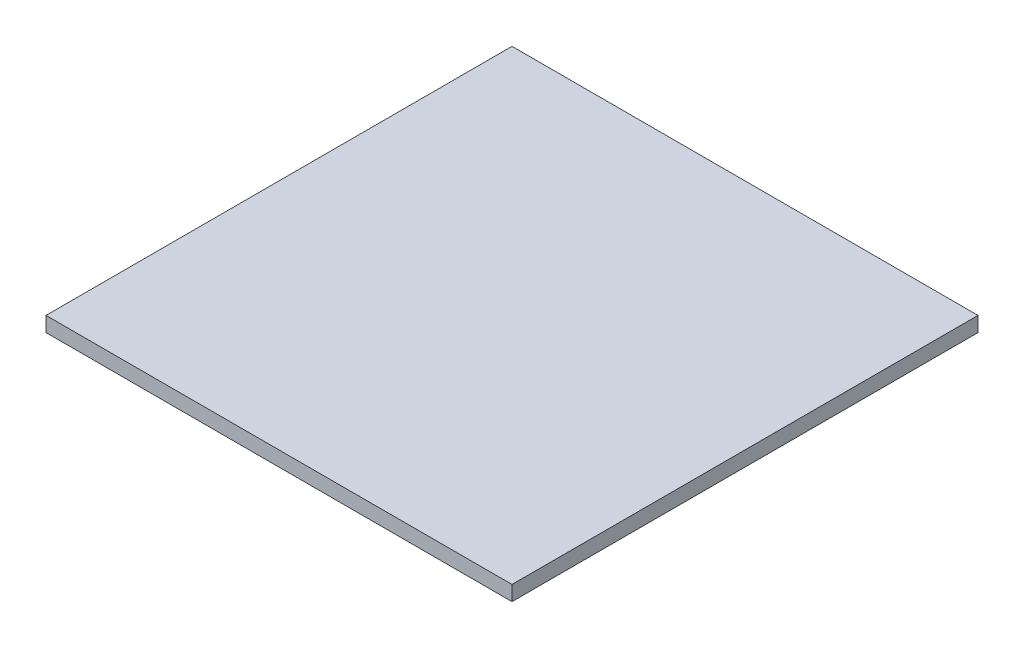
ISO-10303-21;
HEADER;
FILE_DESCRIPTION(('STEP AP214'),'2;1');
FILE_NAME('part.step','',(''),(''),'','','');
FILE_SCHEMA(('AUTOMOTIVE_DESIGN { 1 0 10303 214 1 1 1 1 }'));
ENDSEC;
DATA;
#1=APPLICATION_CONTEXT('core data for automotive mechanical design processes');
#2=APPLICATION_PROTOCOL_DEFINITION('international standard','automotive_design',2000,#1);
#3=PRODUCT_CONTEXT('',#1,'mechanical');
#4=PRODUCT('Part','Part','',(#3));
#5=PRODUCT_RELATED_PRODUCT_CATEGORY('part','',(#4));
#6=PRODUCT_DEFINITION_FORMATION('','',#4);
#7=PRODUCT_DEFINITION_CONTEXT('part definition',#1,'design');
#8=PRODUCT_DEFINITION('design','',#6,#7);
#9=PRODUCT_DEFINITION_SHAPE('','',#8);
#10=(LENGTH_UNIT() NAMED_UNIT(*) SI_UNIT(.MILLI.,.METRE.));
#11=(NAMED_UNIT(*) PLANE_ANGLE_UNIT() SI_UNIT($,.RADIAN.));
#12=(NAMED_UNIT(*) SI_UNIT($,.STERADIAN.) SOLID_ANGLE_UNIT());
#13=UNCERTAINTY_MEASURE_WITH_UNIT(LENGTH_MEASURE(1.E-05),#10,'distance_accuracy_value','');
#14=(GEOMETRIC_REPRESENTATION_CONTEXT(3) GLOBAL_UNCERTAINTY_ASSIGNED_CONTEXT((#13)) GLOBAL_UNIT_ASSIGNED_CONTEXT((#10,
#11,#12)) REPRESENTATION_CONTEXT('',''));
#15=CARTESIAN_POINT('',(0.,0.,0.));
#16=DIRECTION('',(0.,0.,1.));
#17=DIRECTION('',(1.,0.,0.));
#18=AXIS2_PLACEMENT_3D('',#15,#16,#17);
#19=CARTESIAN_POINT('',(25.,1.6,-25.));
#20=DIRECTION('',(-1.,0.,0.));
#21=DIRECTION('',(0.,0.,1.));
#22=AXIS2_PLACEMENT_3D('',#19,#20,#21);
#23=PLANE('',#22);
#24=DIRECTION('',(0.,0.,-1.));
#25=VECTOR('',#24,1.);
#26=CARTESIAN_POINT('',(25.,0.,-25.));
#27=LINE('',#26,#25);
#28=CARTESIAN_POINT('',(25.,0.,25.));
#29=VERTEX_POINT('',#28);
#30=CARTESIAN_POINT('',(25.,0.,-25.));
#31=VERTEX_POINT('',#30);
#32=EDGE_CURVE('E98',#29,#31,#27,.T.);
#33=ORIENTED_EDGE('',*,*,#32,.T.);
#34=DIRECTION('',(0.,-1.,0.));
#35=VECTOR('',#34,1.);
#36=CARTESIAN_POINT('',(25.,1.6,-25.));
#37=LINE('',#36,#35);
#38=CARTESIAN_POINT('',(25.,1.6,-25.));
#39=VERTEX_POINT('',#38);
#40=EDGE_CURVE('E11',#39,#31,#37,.T.);
#41=ORIENTED_EDGE('',*,*,#40,.F.);
#42=DIRECTION('',(0.,0.,-1.));
#43=VECTOR('',#42,1.);
#44=CARTESIAN_POINT('',(25.,1.6,-25.));
#45=LINE('',#44,#43);
#46=CARTESIAN_POINT('',(25.,1.6,25.));
#47=VERTEX_POINT('',#46);
#48=EDGE_CURVE('E86',#47,#39,#45,.T.);
#49=ORIENTED_EDGE('',*,*,#48,.F.);
#50=DIRECTION('',(0.,-1.,0.));
#51=VECTOR('',#50,1.);
#52=CARTESIAN_POINT('',(25.,1.6,25.));
#53=LINE('',#52,#51);
#54=EDGE_CURVE('E94',#47,#29,#53,.T.);
#55=ORIENTED_EDGE('',*,*,#54,.T.);
#56=EDGE_LOOP('',(#33,#41,#49,#55));
#57=FACE_BOUND('',#56,.T.);
#58=ADVANCED_FACE('F35',(#57),#23,.F.);
#59=CARTESIAN_POINT('',(-25.,1.6,-25.));
#60=DIRECTION('',(0.,0.,1.));
#61=DIRECTION('',(1.,0.,0.));
#62=AXIS2_PLACEMENT_3D('',#59,#60,#61);
#63=PLANE('',#62);
#64=DIRECTION('',(-1.,0.,0.));
#65=VECTOR('',#64,1.);
#66=CARTESIAN_POINT('',(-25.,0.,-25.));
#67=LINE('',#66,#65);
#68=CARTESIAN_POINT('',(-25.,0.,-25.));
#69=VERTEX_POINT('',#68);
#70=EDGE_CURVE('E90',#31,#69,#67,.T.);
#71=ORIENTED_EDGE('',*,*,#70,.T.);
#72=DIRECTION('',(0.,-1.,0.));
#73=VECTOR('',#72,1.);
#74=CARTESIAN_POINT('',(-25.,1.6,-25.));
#75=LINE('',#74,#73);
#76=CARTESIAN_POINT('',(-25.,1.6,-25.));
#77=VERTEX_POINT('',#76);
#78=EDGE_CURVE('E43',#77,#69,#75,.T.);
#79=ORIENTED_EDGE('',*,*,#78,.F.);
#80=DIRECTION('',(-1.,0.,0.));
#81=VECTOR('',#80,1.);
#82=CARTESIAN_POINT('',(-25.,1.6,-25.));
#83=LINE('',#82,#81);
#84=EDGE_CURVE('E81',#39,#77,#83,.T.);
#85=ORIENTED_EDGE('',*,*,#84,.F.);
#86=ORIENTED_EDGE('',*,*,#40,.T.);
#87=EDGE_LOOP('',(#71,#79,#85,#86));
#88=FACE_BOUND('',#87,.T.);
#89=ADVANCED_FACE('F89',(#88),#63,.F.);
#90=CARTESIAN_POINT('',(-25.,1.6,-25.));
#91=DIRECTION('',(1.,0.,0.));
#92=DIRECTION('',(0.,0.,-1.));
#93=AXIS2_PLACEMENT_3D('',#90,#91,#92);
#94=PLANE('',#93);
#95=DIRECTION('',(0.,0.,1.));
#96=VECTOR('',#95,1.);
#97=CARTESIAN_POINT('',(-25.,0.,-25.));
#98=LINE('',#97,#96);
#99=CARTESIAN_POINT('',(-25.,0.,25.));
#100=VERTEX_POINT('',#99);
#101=EDGE_CURVE('E68',#69,#100,#98,.T.);
#102=ORIENTED_EDGE('',*,*,#101,.T.);
#103=DIRECTION('',(0.,-1.,0.));
#104=VECTOR('',#103,1.);
#105=CARTESIAN_POINT('',(-25.,1.6,25.));
#106=LINE('',#105,#104);
#107=CARTESIAN_POINT('',(-25.,1.6,25.));
#108=VERTEX_POINT('',#107);
#109=EDGE_CURVE('E91',#108,#100,#106,.T.);
#110=ORIENTED_EDGE('',*,*,#109,.F.);
#111=DIRECTION('',(0.,0.,1.));
#112=VECTOR('',#111,1.);
#113=CARTESIAN_POINT('',(-25.,1.6,-25.));
#114=LINE('',#113,#112);
#115=EDGE_CURVE('E84',#77,#108,#114,.T.);
#116=ORIENTED_EDGE('',*,*,#115,.F.);
#117=ORIENTED_EDGE('',*,*,#78,.T.);
#118=EDGE_LOOP('',(#102,#110,#116,#117));
#119=FACE_BOUND('',#118,.T.);
#120=ADVANCED_FACE('F92',(#119),#94,.F.);
#121=CARTESIAN_POINT('',(-25.,1.6,25.));
#122=DIRECTION('',(0.,0.,-1.));
#123=DIRECTION('',(-1.,0.,0.));
#124=AXIS2_PLACEMENT_3D('',#121,#122,#123);
#125=PLANE('',#124);
#126=DIRECTION('',(1.,0.,0.));
#127=VECTOR('',#126,1.);
#128=CARTESIAN_POINT('',(-25.,0.,25.));
#129=LINE('',#128,#127);
#130=EDGE_CURVE('E74',#100,#29,#129,.T.);
#131=ORIENTED_EDGE('',*,*,#130,.T.);
#132=ORIENTED_EDGE('',*,*,#54,.F.);
#133=DIRECTION('',(1.,0.,0.));
#134=VECTOR('',#133,1.);
#135=CARTESIAN_POINT('',(-25.,1.6,25.));
#136=LINE('',#135,#134);
#137=EDGE_CURVE('E51',#108,#47,#136,.T.);
#138=ORIENTED_EDGE('',*,*,#137,.F.);
#139=ORIENTED_EDGE('',*,*,#109,.T.);
#140=EDGE_LOOP('',(#131,#132,#138,#139));
#141=FACE_BOUND('',#140,.T.);
#142=ADVANCED_FACE('F105',(#141),#125,.F.);
#143=CARTESIAN_POINT('',(0.,1.6,0.));
#144=DIRECTION('',(0.,1.,0.));
#145=DIRECTION('',(0.,0.,1.));
#146=AXIS2_PLACEMENT_3D('',#143,#144,#145);
#147=PLANE('',#146);
#148=ORIENTED_EDGE('',*,*,#48,.T.);
#149=ORIENTED_EDGE('',*,*,#84,.T.);
#150=ORIENTED_EDGE('',*,*,#115,.T.);
#151=ORIENTED_EDGE('',*,*,#137,.T.);
#152=EDGE_LOOP('',(#148,#149,#150,#151));
#153=FACE_BOUND('',#152,.T.);
#154=ADVANCED_FACE('F82',(#153),#147,.T.);
#155=CARTESIAN_POINT('',(0.,0.,0.));
#156=DIRECTION('',(0.,1.,0.));
#157=DIRECTION('',(0.,0.,1.));
#158=AXIS2_PLACEMENT_3D('',#155,#156,#157);
#159=PLANE('',#158);
#160=ORIENTED_EDGE('',*,*,#32,.F.);
#161=ORIENTED_EDGE('',*,*,#130,.F.);
#162=ORIENTED_EDGE('',*,*,#101,.F.);
#163=ORIENTED_EDGE('',*,*,#70,.F.);
#164=EDGE_LOOP('',(#160,#161,#162,#163));
#165=FACE_BOUND('',#164,.T.);
#166=ADVANCED_FACE('F108',(#165),#159,.F.);
#167=CLOSED_SHELL('',(#58,#89,#120,#142,#154,#166));
#168=MANIFOLD_SOLID_BREP('B2',#167);
#169=ADVANCED_BREP_SHAPE_REPRESENTATION('',(#18,#168),#14);
#170=SHAPE_DEFINITION_REPRESENTATION(#9,#169);
ENDSEC;
END-ISO-10303-21;
